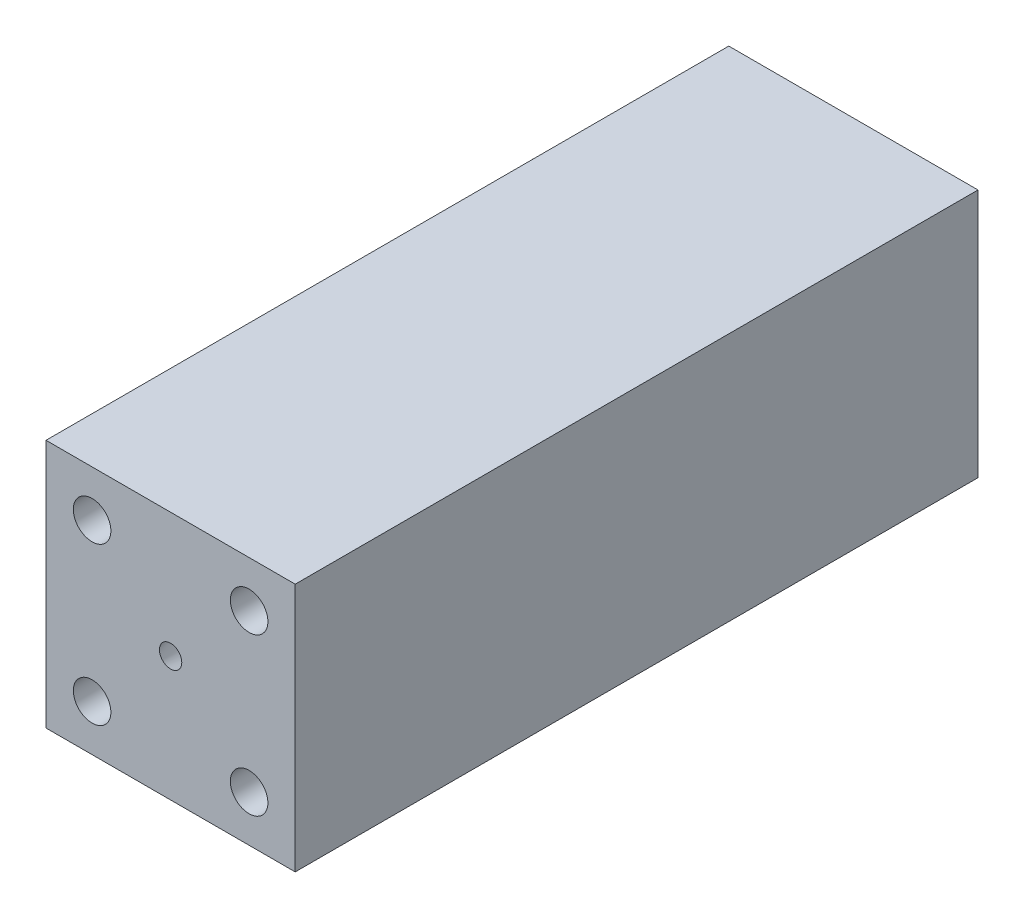
ISO-10303-21;
HEADER;
FILE_DESCRIPTION(('STEP AP214'),'2;1');
FILE_NAME('part.step','',(''),(''),'','','');
FILE_SCHEMA(('AUTOMOTIVE_DESIGN { 1 0 10303 214 1 1 1 1 }'));
ENDSEC;
DATA;
#1=APPLICATION_CONTEXT('core data for automotive mechanical design processes');
#2=APPLICATION_PROTOCOL_DEFINITION('international standard','automotive_design',2000,#1);
#3=PRODUCT_CONTEXT('',#1,'mechanical');
#4=PRODUCT('Part','Part','',(#3));
#5=PRODUCT_RELATED_PRODUCT_CATEGORY('part','',(#4));
#6=PRODUCT_DEFINITION_FORMATION('','',#4);
#7=PRODUCT_DEFINITION_CONTEXT('part definition',#1,'design');
#8=PRODUCT_DEFINITION('design','',#6,#7);
#9=PRODUCT_DEFINITION_SHAPE('','',#8);
#10=(LENGTH_UNIT() NAMED_UNIT(*) SI_UNIT(.MILLI.,.METRE.));
#11=(NAMED_UNIT(*) PLANE_ANGLE_UNIT() SI_UNIT($,.RADIAN.));
#12=(NAMED_UNIT(*) SI_UNIT($,.STERADIAN.) SOLID_ANGLE_UNIT());
#13=UNCERTAINTY_MEASURE_WITH_UNIT(LENGTH_MEASURE(1.E-05),#10,'distance_accuracy_value','');
#14=(GEOMETRIC_REPRESENTATION_CONTEXT(3) GLOBAL_UNCERTAINTY_ASSIGNED_CONTEXT((#13)) GLOBAL_UNIT_ASSIGNED_CONTEXT((#10,
#11,#12)) REPRESENTATION_CONTEXT('',''));
#15=CARTESIAN_POINT('',(0.,0.,0.));
#16=DIRECTION('',(0.,0.,1.));
#17=DIRECTION('',(1.,0.,0.));
#18=AXIS2_PLACEMENT_3D('',#15,#16,#17);
#19=CARTESIAN_POINT('',(0.,0.,127.));
#20=DIRECTION('',(0.,0.,1.));
#21=DIRECTION('',(1.,0.,0.));
#22=AXIS2_PLACEMENT_3D('',#19,#20,#21);
#23=PLANE('',#22);
#24=CARTESIAN_POINT('',(0.,0.,127.));
#25=DIRECTION('',(0.,0.,1.));
#26=DIRECTION('',(0.,-1.,0.));
#27=AXIS2_PLACEMENT_3D('',#24,#25,#26);
#28=CIRCLE('',#27,2.07828610785721);
#29=CARTESIAN_POINT('',(0.,-2.0782861078572,127.));
#30=VERTEX_POINT('',#29);
#31=EDGE_CURVE('E152',#30,#30,#28,.T.);
#32=ORIENTED_EDGE('',*,*,#31,.F.);
#33=EDGE_LOOP('',(#32));
#34=FACE_BOUND('',#33,.T.);
#35=CARTESIAN_POINT('',(14.6018964528584,-14.6018964528585,127.));
#36=DIRECTION('',(0.,0.,-1.));
#37=DIRECTION('',(1.,0.,0.));
#38=AXIS2_PLACEMENT_3D('',#35,#36,#37);
#39=CIRCLE('',#38,3.4925);
#40=CARTESIAN_POINT('',(18.0943964528584,-14.6018964528585,127.));
#41=VERTEX_POINT('',#40);
#42=EDGE_CURVE('E120',#41,#41,#39,.T.);
#43=ORIENTED_EDGE('',*,*,#42,.T.);
#44=EDGE_LOOP('',(#43));
#45=FACE_BOUND('',#44,.T.);
#46=CARTESIAN_POINT('',(14.6018964528584,14.6018964528585,127.));
#47=DIRECTION('',(0.,0.,1.));
#48=DIRECTION('',(1.,0.,0.));
#49=AXIS2_PLACEMENT_3D('',#46,#47,#48);
#50=CIRCLE('',#49,3.4925);
#51=CARTESIAN_POINT('',(18.0943964528584,14.6018964528585,127.));
#52=VERTEX_POINT('',#51);
#53=EDGE_CURVE('E114',#52,#52,#50,.T.);
#54=ORIENTED_EDGE('',*,*,#53,.F.);
#55=EDGE_LOOP('',(#54));
#56=FACE_BOUND('',#55,.T.);
#57=DIRECTION('',(0.,-1.,0.));
#58=VECTOR('',#57,1.);
#59=CARTESIAN_POINT('',(-23.1775,23.1775,127.));
#60=LINE('',#59,#58);
#61=CARTESIAN_POINT('',(-23.1775,23.1775,127.));
#62=VERTEX_POINT('',#61);
#63=CARTESIAN_POINT('',(-23.1775,-23.1775,127.));
#64=VERTEX_POINT('',#63);
#65=EDGE_CURVE('E87',#62,#64,#60,.T.);
#66=ORIENTED_EDGE('',*,*,#65,.T.);
#67=DIRECTION('',(1.,0.,0.));
#68=VECTOR('',#67,1.);
#69=CARTESIAN_POINT('',(-23.1775,-23.1775,127.));
#70=LINE('',#69,#68);
#71=CARTESIAN_POINT('',(23.1775,-23.1775,127.));
#72=VERTEX_POINT('',#71);
#73=EDGE_CURVE('E82',#64,#72,#70,.T.);
#74=ORIENTED_EDGE('',*,*,#73,.T.);
#75=DIRECTION('',(0.,1.,0.));
#76=VECTOR('',#75,1.);
#77=CARTESIAN_POINT('',(23.1775,23.1775,127.));
#78=LINE('',#77,#76);
#79=CARTESIAN_POINT('',(23.1775,23.1775,127.));
#80=VERTEX_POINT('',#79);
#81=EDGE_CURVE('E85',#72,#80,#78,.T.);
#82=ORIENTED_EDGE('',*,*,#81,.T.);
#83=DIRECTION('',(-1.,0.,0.));
#84=VECTOR('',#83,1.);
#85=CARTESIAN_POINT('',(-23.1775,23.1775,127.));
#86=LINE('',#85,#84);
#87=EDGE_CURVE('E52',#80,#62,#86,.T.);
#88=ORIENTED_EDGE('',*,*,#87,.T.);
#89=EDGE_LOOP('',(#66,#74,#82,#88));
#90=FACE_BOUND('',#89,.T.);
#91=CARTESIAN_POINT('',(-14.6018964528584,-14.6018964528585,127.));
#92=DIRECTION('',(0.,0.,1.));
#93=DIRECTION('',(-1.,0.,0.));
#94=AXIS2_PLACEMENT_3D('',#91,#92,#93);
#95=CIRCLE('',#94,3.4925);
#96=CARTESIAN_POINT('',(-18.0943964528584,-14.6018964528585,127.));
#97=VERTEX_POINT('',#96);
#98=EDGE_CURVE('E126',#97,#97,#95,.T.);
#99=ORIENTED_EDGE('',*,*,#98,.F.);
#100=EDGE_LOOP('',(#99));
#101=FACE_BOUND('',#100,.T.);
#102=CARTESIAN_POINT('',(-14.6018964528584,14.6018964528585,127.));
#103=DIRECTION('',(0.,0.,-1.));
#104=DIRECTION('',(-1.,0.,0.));
#105=AXIS2_PLACEMENT_3D('',#102,#103,#104);
#106=CIRCLE('',#105,3.4925);
#107=CARTESIAN_POINT('',(-18.0943964528584,14.6018964528585,127.));
#108=VERTEX_POINT('',#107);
#109=EDGE_CURVE('E132',#108,#108,#106,.T.);
#110=ORIENTED_EDGE('',*,*,#109,.T.);
#111=EDGE_LOOP('',(#110));
#112=FACE_BOUND('',#111,.T.);
#113=ADVANCED_FACE('F35',(#34,#45,#56,#90,#101,#112),#23,.T.);
#114=CARTESIAN_POINT('',(0.,0.,0.));
#115=DIRECTION('',(0.,0.,1.));
#116=DIRECTION('',(1.,0.,0.));
#117=AXIS2_PLACEMENT_3D('',#114,#115,#116);
#118=PLANE('',#117);
#119=CARTESIAN_POINT('',(0.,0.,0.));
#120=DIRECTION('',(0.,0.,1.));
#121=DIRECTION('',(0.,-1.,0.));
#122=AXIS2_PLACEMENT_3D('',#119,#120,#121);
#123=CIRCLE('',#122,14.6018964528585);
#124=CARTESIAN_POINT('',(0.,-14.6018964528585,0.));
#125=VERTEX_POINT('',#124);
#126=EDGE_CURVE('E135',#125,#125,#123,.T.);
#127=ORIENTED_EDGE('',*,*,#126,.T.);
#128=EDGE_LOOP('',(#127));
#129=FACE_BOUND('',#128,.T.);
#130=CARTESIAN_POINT('',(-14.6018964528584,-14.6018964528585,0.));
#131=DIRECTION('',(0.,0.,1.));
#132=DIRECTION('',(-1.,0.,0.));
#133=AXIS2_PLACEMENT_3D('',#130,#131,#132);
#134=CIRCLE('',#133,3.4925);
#135=CARTESIAN_POINT('',(-18.0943964528584,-14.6018964528585,0.));
#136=VERTEX_POINT('',#135);
#137=EDGE_CURVE('E123',#136,#136,#134,.T.);
#138=ORIENTED_EDGE('',*,*,#137,.T.);
#139=EDGE_LOOP('',(#138));
#140=FACE_BOUND('',#139,.T.);
#141=CARTESIAN_POINT('',(14.6018964528584,14.6018964528585,0.));
#142=DIRECTION('',(0.,0.,1.));
#143=DIRECTION('',(1.,0.,0.));
#144=AXIS2_PLACEMENT_3D('',#141,#142,#143);
#145=CIRCLE('',#144,3.4925);
#146=CARTESIAN_POINT('',(18.0943964528584,14.6018964528585,0.));
#147=VERTEX_POINT('',#146);
#148=EDGE_CURVE('E102',#147,#147,#145,.T.);
#149=ORIENTED_EDGE('',*,*,#148,.T.);
#150=EDGE_LOOP('',(#149));
#151=FACE_BOUND('',#150,.T.);
#152=DIRECTION('',(0.,-1.,0.));
#153=VECTOR('',#152,1.);
#154=CARTESIAN_POINT('',(-23.1775,23.1775,0.));
#155=LINE('',#154,#153);
#156=CARTESIAN_POINT('',(-23.1775,23.1775,0.));
#157=VERTEX_POINT('',#156);
#158=CARTESIAN_POINT('',(-23.1775,-23.1775,0.));
#159=VERTEX_POINT('',#158);
#160=EDGE_CURVE('E99',#157,#159,#155,.T.);
#161=ORIENTED_EDGE('',*,*,#160,.F.);
#162=DIRECTION('',(-1.,0.,0.));
#163=VECTOR('',#162,1.);
#164=CARTESIAN_POINT('',(-23.1775,23.1775,0.));
#165=LINE('',#164,#163);
#166=CARTESIAN_POINT('',(23.1775,23.1775,0.));
#167=VERTEX_POINT('',#166);
#168=EDGE_CURVE('E75',#167,#157,#165,.T.);
#169=ORIENTED_EDGE('',*,*,#168,.F.);
#170=DIRECTION('',(0.,1.,0.));
#171=VECTOR('',#170,1.);
#172=CARTESIAN_POINT('',(23.1775,23.1775,0.));
#173=LINE('',#172,#171);
#174=CARTESIAN_POINT('',(23.1775,-23.1775,0.));
#175=VERTEX_POINT('',#174);
#176=EDGE_CURVE('E69',#175,#167,#173,.T.);
#177=ORIENTED_EDGE('',*,*,#176,.F.);
#178=DIRECTION('',(1.,0.,0.));
#179=VECTOR('',#178,1.);
#180=CARTESIAN_POINT('',(-23.1775,-23.1775,0.));
#181=LINE('',#180,#179);
#182=EDGE_CURVE('E91',#159,#175,#181,.T.);
#183=ORIENTED_EDGE('',*,*,#182,.F.);
#184=EDGE_LOOP('',(#161,#169,#177,#183));
#185=FACE_BOUND('',#184,.T.);
#186=CARTESIAN_POINT('',(14.6018964528584,-14.6018964528585,0.));
#187=DIRECTION('',(0.,0.,-1.));
#188=DIRECTION('',(1.,0.,0.));
#189=AXIS2_PLACEMENT_3D('',#186,#187,#188);
#190=CIRCLE('',#189,3.4925);
#191=CARTESIAN_POINT('',(18.0943964528584,-14.6018964528585,0.));
#192=VERTEX_POINT('',#191);
#193=EDGE_CURVE('E117',#192,#192,#190,.T.);
#194=ORIENTED_EDGE('',*,*,#193,.F.);
#195=EDGE_LOOP('',(#194));
#196=FACE_BOUND('',#195,.T.);
#197=CARTESIAN_POINT('',(-14.6018964528584,14.6018964528585,0.));
#198=DIRECTION('',(0.,0.,-1.));
#199=DIRECTION('',(-1.,0.,0.));
#200=AXIS2_PLACEMENT_3D('',#197,#198,#199);
#201=CIRCLE('',#200,3.4925);
#202=CARTESIAN_POINT('',(-18.0943964528584,14.6018964528585,0.));
#203=VERTEX_POINT('',#202);
#204=EDGE_CURVE('E129',#203,#203,#201,.T.);
#205=ORIENTED_EDGE('',*,*,#204,.F.);
#206=EDGE_LOOP('',(#205));
#207=FACE_BOUND('',#206,.T.);
#208=ADVANCED_FACE('F110',(#129,#140,#151,#185,#196,#207),#118,.F.);
#209=CARTESIAN_POINT('',(-23.1775,23.1775,127.));
#210=DIRECTION('',(1.,0.,0.));
#211=DIRECTION('',(0.,1.,0.));
#212=AXIS2_PLACEMENT_3D('',#209,#210,#211);
#213=PLANE('',#212);
#214=ORIENTED_EDGE('',*,*,#160,.T.);
#215=DIRECTION('',(0.,0.,-1.));
#216=VECTOR('',#215,1.);
#217=CARTESIAN_POINT('',(-23.1775,-23.1775,127.));
#218=LINE('',#217,#216);
#219=EDGE_CURVE('E11',#64,#159,#218,.T.);
#220=ORIENTED_EDGE('',*,*,#219,.F.);
#221=ORIENTED_EDGE('',*,*,#65,.F.);
#222=DIRECTION('',(0.,0.,-1.));
#223=VECTOR('',#222,1.);
#224=CARTESIAN_POINT('',(-23.1775,23.1775,127.));
#225=LINE('',#224,#223);
#226=EDGE_CURVE('E95',#62,#157,#225,.T.);
#227=ORIENTED_EDGE('',*,*,#226,.T.);
#228=EDGE_LOOP('',(#214,#220,#221,#227));
#229=FACE_BOUND('',#228,.T.);
#230=ADVANCED_FACE('F37',(#229),#213,.F.);
#231=CARTESIAN_POINT('',(-23.1775,-23.1775,127.));
#232=DIRECTION('',(0.,1.,0.));
#233=DIRECTION('',(0.,0.,1.));
#234=AXIS2_PLACEMENT_3D('',#231,#232,#233);
#235=PLANE('',#234);
#236=ORIENTED_EDGE('',*,*,#182,.T.);
#237=DIRECTION('',(0.,0.,-1.));
#238=VECTOR('',#237,1.);
#239=CARTESIAN_POINT('',(23.1775,-23.1775,127.));
#240=LINE('',#239,#238);
#241=EDGE_CURVE('E44',#72,#175,#240,.T.);
#242=ORIENTED_EDGE('',*,*,#241,.F.);
#243=ORIENTED_EDGE('',*,*,#73,.F.);
#244=ORIENTED_EDGE('',*,*,#219,.T.);
#245=EDGE_LOOP('',(#236,#242,#243,#244));
#246=FACE_BOUND('',#245,.T.);
#247=ADVANCED_FACE('F90',(#246),#235,.F.);
#248=CARTESIAN_POINT('',(23.1775,23.1775,127.));
#249=DIRECTION('',(-1.,0.,0.));
#250=DIRECTION('',(0.,-1.,0.));
#251=AXIS2_PLACEMENT_3D('',#248,#249,#250);
#252=PLANE('',#251);
#253=ORIENTED_EDGE('',*,*,#176,.T.);
#254=DIRECTION('',(0.,0.,-1.));
#255=VECTOR('',#254,1.);
#256=CARTESIAN_POINT('',(23.1775,23.1775,127.));
#257=LINE('',#256,#255);
#258=EDGE_CURVE('E92',#80,#167,#257,.T.);
#259=ORIENTED_EDGE('',*,*,#258,.F.);
#260=ORIENTED_EDGE('',*,*,#81,.F.);
#261=ORIENTED_EDGE('',*,*,#241,.T.);
#262=EDGE_LOOP('',(#253,#259,#260,#261));
#263=FACE_BOUND('',#262,.T.);
#264=ADVANCED_FACE('F93',(#263),#252,.F.);
#265=CARTESIAN_POINT('',(-23.1775,23.1775,127.));
#266=DIRECTION('',(0.,-1.,0.));
#267=DIRECTION('',(0.,0.,-1.));
#268=AXIS2_PLACEMENT_3D('',#265,#266,#267);
#269=PLANE('',#268);
#270=ORIENTED_EDGE('',*,*,#168,.T.);
#271=ORIENTED_EDGE('',*,*,#226,.F.);
#272=ORIENTED_EDGE('',*,*,#87,.F.);
#273=ORIENTED_EDGE('',*,*,#258,.T.);
#274=EDGE_LOOP('',(#270,#271,#272,#273));
#275=FACE_BOUND('',#274,.T.);
#276=ADVANCED_FACE('F107',(#275),#269,.F.);
#277=CARTESIAN_POINT('',(14.6018964528584,14.6018964528585,0.));
#278=DIRECTION('',(0.,0.,1.));
#279=DIRECTION('',(1.,0.,0.));
#280=AXIS2_PLACEMENT_3D('',#277,#278,#279);
#281=CYLINDRICAL_SURFACE('',#280,3.4925);
#282=ORIENTED_EDGE('',*,*,#148,.F.);
#283=EDGE_LOOP('',(#282));
#284=FACE_BOUND('',#283,.T.);
#285=ORIENTED_EDGE('',*,*,#53,.T.);
#286=EDGE_LOOP('',(#285));
#287=FACE_BOUND('',#286,.T.);
#288=ADVANCED_FACE('F166',(#284,#287),#281,.F.);
#289=CARTESIAN_POINT('',(14.6018964528584,-14.6018964528585,0.));
#290=DIRECTION('',(0.,0.,1.));
#291=DIRECTION('',(1.,0.,0.));
#292=AXIS2_PLACEMENT_3D('',#289,#290,#291);
#293=CYLINDRICAL_SURFACE('',#292,3.4925);
#294=ORIENTED_EDGE('',*,*,#193,.T.);
#295=EDGE_LOOP('',(#294));
#296=FACE_BOUND('',#295,.T.);
#297=ORIENTED_EDGE('',*,*,#42,.F.);
#298=EDGE_LOOP('',(#297));
#299=FACE_BOUND('',#298,.T.);
#300=ADVANCED_FACE('F168',(#296,#299),#293,.F.);
#301=CARTESIAN_POINT('',(-14.6018964528584,-14.6018964528585,0.));
#302=DIRECTION('',(0.,0.,1.));
#303=DIRECTION('',(1.,0.,0.));
#304=AXIS2_PLACEMENT_3D('',#301,#302,#303);
#305=CYLINDRICAL_SURFACE('',#304,3.4925);
#306=ORIENTED_EDGE('',*,*,#137,.F.);
#307=EDGE_LOOP('',(#306));
#308=FACE_BOUND('',#307,.T.);
#309=ORIENTED_EDGE('',*,*,#98,.T.);
#310=EDGE_LOOP('',(#309));
#311=FACE_BOUND('',#310,.T.);
#312=ADVANCED_FACE('F175',(#308,#311),#305,.F.);
#313=CARTESIAN_POINT('',(-14.6018964528584,14.6018964528585,0.));
#314=DIRECTION('',(0.,0.,1.));
#315=DIRECTION('',(1.,0.,0.));
#316=AXIS2_PLACEMENT_3D('',#313,#314,#315);
#317=CYLINDRICAL_SURFACE('',#316,3.4925);
#318=ORIENTED_EDGE('',*,*,#204,.T.);
#319=EDGE_LOOP('',(#318));
#320=FACE_BOUND('',#319,.T.);
#321=ORIENTED_EDGE('',*,*,#109,.F.);
#322=EDGE_LOOP('',(#321));
#323=FACE_BOUND('',#322,.T.);
#324=ADVANCED_FACE('F207',(#320,#323),#317,.F.);
#325=CARTESIAN_POINT('',(0.,0.,127.));
#326=DIRECTION('',(0.,0.,1.));
#327=DIRECTION('',(0.,-1.,0.));
#328=AXIS2_PLACEMENT_3D('',#325,#326,#327);
#329=CYLINDRICAL_SURFACE('',#328,14.6018964528585);
#330=CARTESIAN_POINT('',(0.,0.,44.712215564345));
#331=DIRECTION('',(0.,0.,1.));
#332=DIRECTION('',(0.,-1.,0.));
#333=AXIS2_PLACEMENT_3D('',#330,#331,#332);
#334=CIRCLE('',#333,14.6018964528585);
#335=CARTESIAN_POINT('',(0.,-14.6018964528585,44.712215564345));
#336=VERTEX_POINT('',#335);
#337=EDGE_CURVE('E140',#336,#336,#334,.T.);
#338=ORIENTED_EDGE('',*,*,#337,.T.);
#339=EDGE_LOOP('',(#338));
#340=FACE_BOUND('',#339,.T.);
#341=ORIENTED_EDGE('',*,*,#126,.F.);
#342=EDGE_LOOP('',(#341));
#343=FACE_BOUND('',#342,.T.);
#344=ADVANCED_FACE('F212',(#340,#343),#329,.F.);
#345=CARTESIAN_POINT('',(0.,0.,44.712215564345));
#346=DIRECTION('',(0.,0.,-1.));
#347=DIRECTION('',(0.,1.,0.));
#348=AXIS2_PLACEMENT_3D('',#345,#346,#347);
#349=CONICAL_SURFACE('',#348,14.6018964528585,0.450804051106243);
#350=CARTESIAN_POINT('',(0.,0.,70.58492463301));
#351=DIRECTION('',(0.,0.,1.));
#352=DIRECTION('',(0.,-1.,0.));
#353=AXIS2_PLACEMENT_3D('',#350,#351,#352);
#354=CIRCLE('',#353,2.07828610785721);
#355=CARTESIAN_POINT('',(0.,-2.07828610785721,70.58492463301));
#356=VERTEX_POINT('',#355);
#357=EDGE_CURVE('E143',#356,#356,#354,.T.);
#358=ORIENTED_EDGE('',*,*,#357,.T.);
#359=EDGE_LOOP('',(#358));
#360=FACE_BOUND('',#359,.T.);
#361=ORIENTED_EDGE('',*,*,#337,.F.);
#362=EDGE_LOOP('',(#361));
#363=FACE_BOUND('',#362,.T.);
#364=ADVANCED_FACE('F260',(#360,#363),#349,.F.);
#365=CARTESIAN_POINT('',(0.,2.07828610785722,70.58492463301));
#366=DIRECTION('',(0.,0.,1.));
#367=DIRECTION('',(0.,-1.,0.));
#368=AXIS2_PLACEMENT_3D('',#365,#366,#367);
#369=PLANE('',#368);
#370=CARTESIAN_POINT('',(0.,0.,70.58492463301));
#371=DIRECTION('',(0.,0.,1.));
#372=DIRECTION('',(0.,-1.,0.));
#373=AXIS2_PLACEMENT_3D('',#370,#371,#372);
#374=CIRCLE('',#373,13.3434369463668);
#375=CARTESIAN_POINT('',(0.,-13.3434369463668,70.58492463301));
#376=VERTEX_POINT('',#375);
#377=EDGE_CURVE('E146',#376,#376,#374,.T.);
#378=ORIENTED_EDGE('',*,*,#377,.T.);
#379=EDGE_LOOP('',(#378));
#380=FACE_BOUND('',#379,.T.);
#381=ORIENTED_EDGE('',*,*,#357,.F.);
#382=EDGE_LOOP('',(#381));
#383=FACE_BOUND('',#382,.T.);
#384=ADVANCED_FACE('F264',(#380,#383),#369,.T.);
#385=CARTESIAN_POINT('',(0.,0.,127.));
#386=DIRECTION('',(0.,0.,1.));
#387=DIRECTION('',(0.,-1.,0.));
#388=AXIS2_PLACEMENT_3D('',#385,#386,#387);
#389=CYLINDRICAL_SURFACE('',#388,13.3434369463668);
#390=CARTESIAN_POINT('',(0.,0.,87.2969615912386));
#391=DIRECTION('',(0.,0.,1.));
#392=DIRECTION('',(0.,-1.,0.));
#393=AXIS2_PLACEMENT_3D('',#390,#391,#392);
#394=CIRCLE('',#393,13.3434369463668);
#395=CARTESIAN_POINT('',(0.,-13.3434369463668,87.2969615912386));
#396=VERTEX_POINT('',#395);
#397=EDGE_CURVE('E149',#396,#396,#394,.T.);
#398=ORIENTED_EDGE('',*,*,#397,.T.);
#399=EDGE_LOOP('',(#398));
#400=FACE_BOUND('',#399,.T.);
#401=ORIENTED_EDGE('',*,*,#377,.F.);
#402=EDGE_LOOP('',(#401));
#403=FACE_BOUND('',#402,.T.);
#404=ADVANCED_FACE('F268',(#400,#403),#389,.F.);
#405=CARTESIAN_POINT('',(0.,0.,87.2969615912386));
#406=DIRECTION('',(0.,0.,-1.));
#407=DIRECTION('',(0.,1.,0.));
#408=AXIS2_PLACEMENT_3D('',#405,#406,#407);
#409=CONICAL_SURFACE('',#408,13.3434369463668,0.276469013445335);
#410=ORIENTED_EDGE('',*,*,#31,.T.);
#411=EDGE_LOOP('',(#410));
#412=FACE_BOUND('',#411,.T.);
#413=ORIENTED_EDGE('',*,*,#397,.F.);
#414=EDGE_LOOP('',(#413));
#415=FACE_BOUND('',#414,.T.);
#416=ADVANCED_FACE('F156',(#412,#415),#409,.F.);
#417=CLOSED_SHELL('',(#113,#208,#230,#247,#264,#276,#288,#300,#312,#324,#344,#364,#384,#404,#416));
#418=MANIFOLD_SOLID_BREP('B2',#417);
#419=ADVANCED_BREP_SHAPE_REPRESENTATION('',(#18,#418),#14);
#420=SHAPE_DEFINITION_REPRESENTATION(#9,#419);
ENDSEC;
END-ISO-10303-21;
